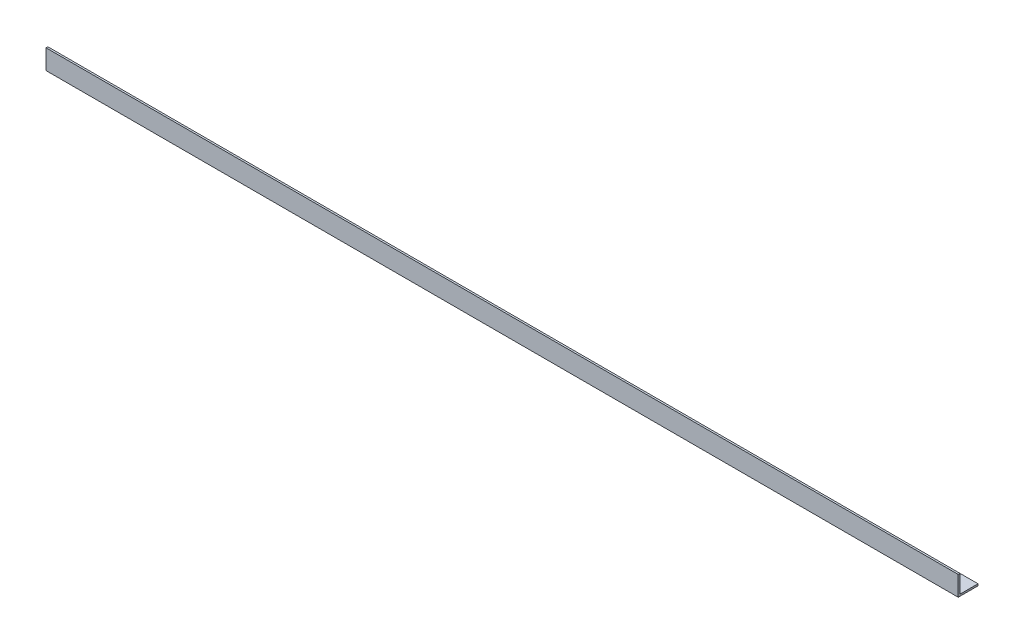
ISO-10303-21;
HEADER;
FILE_DESCRIPTION(('STEP AP214'),'2;1');
FILE_NAME('part.step','',(''),(''),'','','');
FILE_SCHEMA(('AUTOMOTIVE_DESIGN { 1 0 10303 214 1 1 1 1 }'));
ENDSEC;
DATA;
#1=APPLICATION_CONTEXT('core data for automotive mechanical design processes');
#2=APPLICATION_PROTOCOL_DEFINITION('international standard','automotive_design',2000,#1);
#3=PRODUCT_CONTEXT('',#1,'mechanical');
#4=PRODUCT('Part','Part','',(#3));
#5=PRODUCT_RELATED_PRODUCT_CATEGORY('part','',(#4));
#6=PRODUCT_DEFINITION_FORMATION('','',#4);
#7=PRODUCT_DEFINITION_CONTEXT('part definition',#1,'design');
#8=PRODUCT_DEFINITION('design','',#6,#7);
#9=PRODUCT_DEFINITION_SHAPE('','',#8);
#10=(LENGTH_UNIT() NAMED_UNIT(*) SI_UNIT(.MILLI.,.METRE.));
#11=(NAMED_UNIT(*) PLANE_ANGLE_UNIT() SI_UNIT($,.RADIAN.));
#12=(NAMED_UNIT(*) SI_UNIT($,.STERADIAN.) SOLID_ANGLE_UNIT());
#13=UNCERTAINTY_MEASURE_WITH_UNIT(LENGTH_MEASURE(1.E-05),#10,'distance_accuracy_value','');
#14=(GEOMETRIC_REPRESENTATION_CONTEXT(3) GLOBAL_UNCERTAINTY_ASSIGNED_CONTEXT((#13)) GLOBAL_UNIT_ASSIGNED_CONTEXT((#10,
#11,#12)) REPRESENTATION_CONTEXT('',''));
#15=CARTESIAN_POINT('',(0.,0.,0.));
#16=DIRECTION('',(0.,0.,1.));
#17=DIRECTION('',(1.,0.,0.));
#18=AXIS2_PLACEMENT_3D('',#15,#16,#17);
#19=CARTESIAN_POINT('',(3000.,0.,-6.));
#20=DIRECTION('',(0.,0.,1.));
#21=DIRECTION('',(1.,0.,0.));
#22=AXIS2_PLACEMENT_3D('',#19,#20,#21);
#23=PLANE('',#22);
#24=DIRECTION('',(0.,1.,0.));
#25=VECTOR('',#24,1.);
#26=CARTESIAN_POINT('',(0.,0.,-6.));
#27=LINE('',#26,#25);
#28=CARTESIAN_POINT('',(0.,6.,-6.));
#29=VERTEX_POINT('',#28);
#30=CARTESIAN_POINT('',(0.,65.,-6.));
#31=VERTEX_POINT('',#30);
#32=EDGE_CURVE('E115',#29,#31,#27,.T.);
#33=ORIENTED_EDGE('',*,*,#32,.T.);
#34=DIRECTION('',(-1.,0.,0.));
#35=VECTOR('',#34,1.);
#36=CARTESIAN_POINT('',(3000.,65.,-6.));
#37=LINE('',#36,#35);
#38=CARTESIAN_POINT('',(3000.,65.,-6.));
#39=VERTEX_POINT('',#38);
#40=EDGE_CURVE('E11',#39,#31,#37,.T.);
#41=ORIENTED_EDGE('',*,*,#40,.F.);
#42=DIRECTION('',(0.,1.,0.));
#43=VECTOR('',#42,1.);
#44=CARTESIAN_POINT('',(3000.,0.,-6.));
#45=LINE('',#44,#43);
#46=CARTESIAN_POINT('',(3000.,6.,-6.));
#47=VERTEX_POINT('',#46);
#48=EDGE_CURVE('E80',#47,#39,#45,.T.);
#49=ORIENTED_EDGE('',*,*,#48,.F.);
#50=DIRECTION('',(-1.,0.,0.));
#51=VECTOR('',#50,1.);
#52=CARTESIAN_POINT('',(3000.,6.,-6.));
#53=LINE('',#52,#51);
#54=EDGE_CURVE('E111',#47,#29,#53,.T.);
#55=ORIENTED_EDGE('',*,*,#54,.T.);
#56=EDGE_LOOP('',(#33,#41,#49,#55));
#57=FACE_BOUND('',#56,.T.);
#58=ADVANCED_FACE('F34',(#57),#23,.F.);
#59=CARTESIAN_POINT('',(3000.,65.,0.));
#60=DIRECTION('',(0.,1.,0.));
#61=DIRECTION('',(0.,0.,1.));
#62=AXIS2_PLACEMENT_3D('',#59,#60,#61);
#63=PLANE('',#62);
#64=DIRECTION('',(0.,0.,-1.));
#65=VECTOR('',#64,1.);
#66=CARTESIAN_POINT('',(0.,65.,0.));
#67=LINE('',#66,#65);
#68=CARTESIAN_POINT('',(0.,65.,0.));
#69=VERTEX_POINT('',#68);
#70=EDGE_CURVE('E118',#69,#31,#67,.T.);
#71=ORIENTED_EDGE('',*,*,#70,.F.);
#72=DIRECTION('',(-1.,0.,0.));
#73=VECTOR('',#72,1.);
#74=CARTESIAN_POINT('',(3000.,65.,0.));
#75=LINE('',#74,#73);
#76=CARTESIAN_POINT('',(3000.,65.,0.));
#77=VERTEX_POINT('',#76);
#78=EDGE_CURVE('E42',#77,#69,#75,.T.);
#79=ORIENTED_EDGE('',*,*,#78,.F.);
#80=DIRECTION('',(0.,0.,-1.));
#81=VECTOR('',#80,1.);
#82=CARTESIAN_POINT('',(3000.,65.,0.));
#83=LINE('',#82,#81);
#84=EDGE_CURVE('E204',#77,#39,#83,.T.);
#85=ORIENTED_EDGE('',*,*,#84,.T.);
#86=ORIENTED_EDGE('',*,*,#40,.T.);
#87=EDGE_LOOP('',(#71,#79,#85,#86));
#88=FACE_BOUND('',#87,.T.);
#89=ADVANCED_FACE('F136',(#88),#63,.T.);
#90=CARTESIAN_POINT('',(3000.,0.,0.));
#91=DIRECTION('',(0.,0.,1.));
#92=DIRECTION('',(1.,0.,0.));
#93=AXIS2_PLACEMENT_3D('',#90,#91,#92);
#94=PLANE('',#93);
#95=DIRECTION('',(0.,1.,0.));
#96=VECTOR('',#95,1.);
#97=CARTESIAN_POINT('',(0.,0.,0.));
#98=LINE('',#97,#96);
#99=CARTESIAN_POINT('',(0.,0.,0.));
#100=VERTEX_POINT('',#99);
#101=EDGE_CURVE('E121',#100,#69,#98,.T.);
#102=ORIENTED_EDGE('',*,*,#101,.F.);
#103=DIRECTION('',(-1.,0.,0.));
#104=VECTOR('',#103,1.);
#105=CARTESIAN_POINT('',(3000.,0.,0.));
#106=LINE('',#105,#104);
#107=CARTESIAN_POINT('',(3000.,0.,0.));
#108=VERTEX_POINT('',#107);
#109=EDGE_CURVE('E101',#108,#100,#106,.T.);
#110=ORIENTED_EDGE('',*,*,#109,.F.);
#111=DIRECTION('',(0.,1.,0.));
#112=VECTOR('',#111,1.);
#113=CARTESIAN_POINT('',(3000.,0.,0.));
#114=LINE('',#113,#112);
#115=EDGE_CURVE('E107',#108,#77,#114,.T.);
#116=ORIENTED_EDGE('',*,*,#115,.T.);
#117=ORIENTED_EDGE('',*,*,#78,.T.);
#118=EDGE_LOOP('',(#102,#110,#116,#117));
#119=FACE_BOUND('',#118,.T.);
#120=ADVANCED_FACE('F133',(#119),#94,.T.);
#121=CARTESIAN_POINT('',(3000.,0.,0.));
#122=DIRECTION('',(0.,-1.,0.));
#123=DIRECTION('',(0.,0.,-1.));
#124=AXIS2_PLACEMENT_3D('',#121,#122,#123);
#125=PLANE('',#124);
#126=DIRECTION('',(0.,0.,1.));
#127=VECTOR('',#126,1.);
#128=CARTESIAN_POINT('',(0.,0.,0.));
#129=LINE('',#128,#127);
#130=CARTESIAN_POINT('',(0.,0.,-65.));
#131=VERTEX_POINT('',#130);
#132=EDGE_CURVE('E96',#131,#100,#129,.T.);
#133=ORIENTED_EDGE('',*,*,#132,.F.);
#134=DIRECTION('',(-1.,0.,0.));
#135=VECTOR('',#134,1.);
#136=CARTESIAN_POINT('',(3000.,0.,-65.));
#137=LINE('',#136,#135);
#138=CARTESIAN_POINT('',(3000.,0.,-65.));
#139=VERTEX_POINT('',#138);
#140=EDGE_CURVE('E91',#139,#131,#137,.T.);
#141=ORIENTED_EDGE('',*,*,#140,.F.);
#142=DIRECTION('',(0.,0.,1.));
#143=VECTOR('',#142,1.);
#144=CARTESIAN_POINT('',(3000.,0.,0.));
#145=LINE('',#144,#143);
#146=EDGE_CURVE('E94',#139,#108,#145,.T.);
#147=ORIENTED_EDGE('',*,*,#146,.T.);
#148=ORIENTED_EDGE('',*,*,#109,.T.);
#149=EDGE_LOOP('',(#133,#141,#147,#148));
#150=FACE_BOUND('',#149,.T.);
#151=ADVANCED_FACE('F93',(#150),#125,.T.);
#152=CARTESIAN_POINT('',(3000.,6.,-65.));
#153=DIRECTION('',(0.,0.,-1.));
#154=DIRECTION('',(-1.,0.,0.));
#155=AXIS2_PLACEMENT_3D('',#152,#153,#154);
#156=PLANE('',#155);
#157=DIRECTION('',(0.,-1.,0.));
#158=VECTOR('',#157,1.);
#159=CARTESIAN_POINT('',(0.,6.,-65.));
#160=LINE('',#159,#158);
#161=CARTESIAN_POINT('',(0.,6.,-65.));
#162=VERTEX_POINT('',#161);
#163=EDGE_CURVE('E125',#162,#131,#160,.T.);
#164=ORIENTED_EDGE('',*,*,#163,.F.);
#165=DIRECTION('',(-1.,0.,0.));
#166=VECTOR('',#165,1.);
#167=CARTESIAN_POINT('',(3000.,6.,-65.));
#168=LINE('',#167,#166);
#169=CARTESIAN_POINT('',(3000.,6.,-65.));
#170=VERTEX_POINT('',#169);
#171=EDGE_CURVE('E71',#170,#162,#168,.T.);
#172=ORIENTED_EDGE('',*,*,#171,.F.);
#173=DIRECTION('',(0.,-1.,0.));
#174=VECTOR('',#173,1.);
#175=CARTESIAN_POINT('',(3000.,6.,-65.));
#176=LINE('',#175,#174);
#177=EDGE_CURVE('E105',#170,#139,#176,.T.);
#178=ORIENTED_EDGE('',*,*,#177,.T.);
#179=ORIENTED_EDGE('',*,*,#140,.T.);
#180=EDGE_LOOP('',(#164,#172,#178,#179));
#181=FACE_BOUND('',#180,.T.);
#182=ADVANCED_FACE('F109',(#181),#156,.T.);
#183=CARTESIAN_POINT('',(3000.,6.,0.));
#184=DIRECTION('',(0.,-1.,0.));
#185=DIRECTION('',(0.,0.,-1.));
#186=AXIS2_PLACEMENT_3D('',#183,#184,#185);
#187=PLANE('',#186);
#188=DIRECTION('',(0.,0.,-1.));
#189=VECTOR('',#188,1.);
#190=CARTESIAN_POINT('',(0.,6.,0.));
#191=LINE('',#190,#189);
#192=EDGE_CURVE('E74',#162,#29,#191,.F.);
#193=ORIENTED_EDGE('',*,*,#192,.T.);
#194=ORIENTED_EDGE('',*,*,#54,.F.);
#195=DIRECTION('',(0.,0.,-1.));
#196=VECTOR('',#195,1.);
#197=CARTESIAN_POINT('',(3000.,6.,0.));
#198=LINE('',#197,#196);
#199=EDGE_CURVE('E50',#170,#47,#198,.F.);
#200=ORIENTED_EDGE('',*,*,#199,.F.);
#201=ORIENTED_EDGE('',*,*,#171,.T.);
#202=EDGE_LOOP('',(#193,#194,#200,#201));
#203=FACE_BOUND('',#202,.T.);
#204=ADVANCED_FACE('F141',(#203),#187,.F.);
#205=CARTESIAN_POINT('',(3000.,0.,0.));
#206=DIRECTION('',(-1.,0.,0.));
#207=DIRECTION('',(0.,0.,1.));
#208=AXIS2_PLACEMENT_3D('',#205,#206,#207);
#209=PLANE('',#208);
#210=ORIENTED_EDGE('',*,*,#48,.T.);
#211=ORIENTED_EDGE('',*,*,#84,.F.);
#212=ORIENTED_EDGE('',*,*,#115,.F.);
#213=ORIENTED_EDGE('',*,*,#146,.F.);
#214=ORIENTED_EDGE('',*,*,#177,.F.);
#215=ORIENTED_EDGE('',*,*,#199,.T.);
#216=EDGE_LOOP('',(#210,#211,#212,#213,#214,#215));
#217=FACE_BOUND('',#216,.T.);
#218=ADVANCED_FACE('F104',(#217),#209,.F.);
#219=CARTESIAN_POINT('',(0.,0.,0.));
#220=DIRECTION('',(-1.,0.,0.));
#221=DIRECTION('',(0.,0.,1.));
#222=AXIS2_PLACEMENT_3D('',#219,#220,#221);
#223=PLANE('',#222);
#224=ORIENTED_EDGE('',*,*,#32,.F.);
#225=ORIENTED_EDGE('',*,*,#192,.F.);
#226=ORIENTED_EDGE('',*,*,#163,.T.);
#227=ORIENTED_EDGE('',*,*,#132,.T.);
#228=ORIENTED_EDGE('',*,*,#101,.T.);
#229=ORIENTED_EDGE('',*,*,#70,.T.);
#230=EDGE_LOOP('',(#224,#225,#226,#227,#228,#229));
#231=FACE_BOUND('',#230,.T.);
#232=ADVANCED_FACE('F139',(#231),#223,.T.);
#233=CLOSED_SHELL('',(#58,#89,#120,#151,#182,#204,#218,#232));
#234=MANIFOLD_SOLID_BREP('B2',#233);
#235=ADVANCED_BREP_SHAPE_REPRESENTATION('',(#18,#234),#14);
#236=SHAPE_DEFINITION_REPRESENTATION(#9,#235);
ENDSEC;
END-ISO-10303-21;
